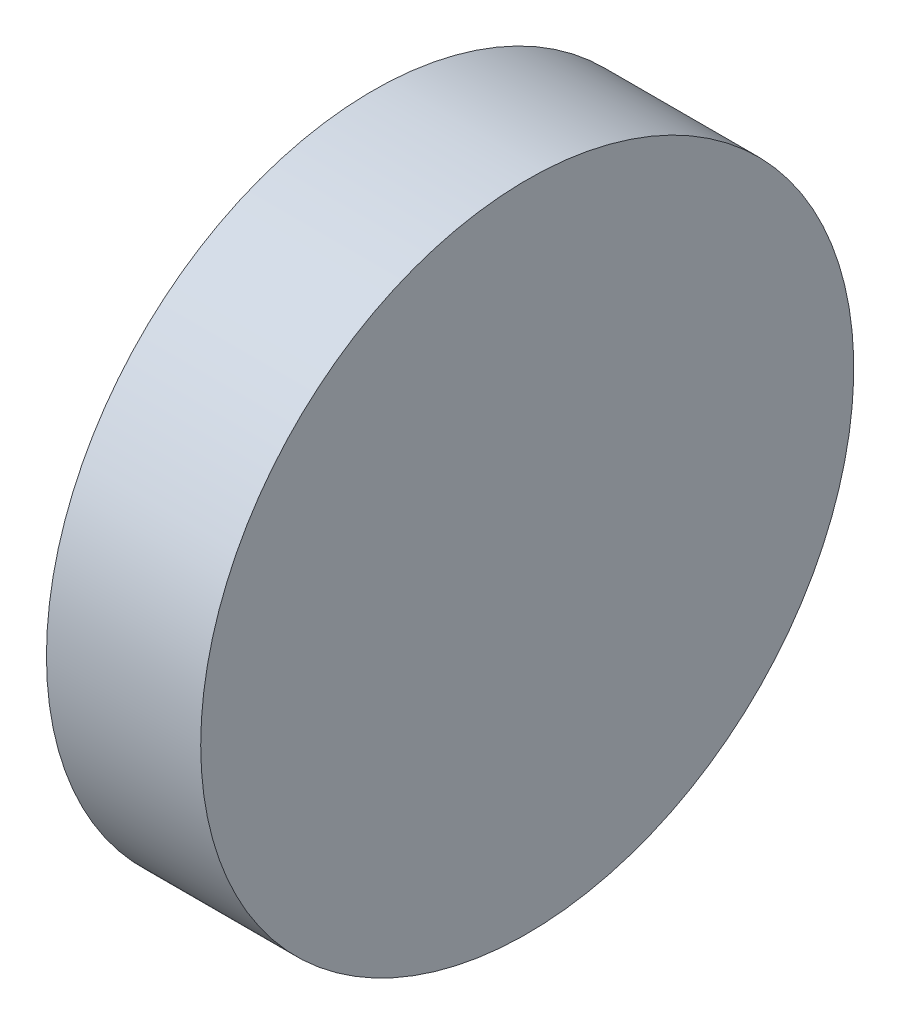
ISO-10303-21;
HEADER;
FILE_DESCRIPTION(('STEP AP214'),'2;1');
FILE_NAME('part.step','',(''),(''),'','','');
FILE_SCHEMA(('AUTOMOTIVE_DESIGN { 1 0 10303 214 1 1 1 1 }'));
ENDSEC;
DATA;
#1=APPLICATION_CONTEXT('core data for automotive mechanical design processes');
#2=APPLICATION_PROTOCOL_DEFINITION('international standard','automotive_design',2000,#1);
#3=PRODUCT_CONTEXT('',#1,'mechanical');
#4=PRODUCT('Part','Part','',(#3));
#5=PRODUCT_RELATED_PRODUCT_CATEGORY('part','',(#4));
#6=PRODUCT_DEFINITION_FORMATION('','',#4);
#7=PRODUCT_DEFINITION_CONTEXT('part definition',#1,'design');
#8=PRODUCT_DEFINITION('design','',#6,#7);
#9=PRODUCT_DEFINITION_SHAPE('','',#8);
#10=(LENGTH_UNIT() NAMED_UNIT(*) SI_UNIT(.MILLI.,.METRE.));
#11=(NAMED_UNIT(*) PLANE_ANGLE_UNIT() SI_UNIT($,.RADIAN.));
#12=(NAMED_UNIT(*) SI_UNIT($,.STERADIAN.) SOLID_ANGLE_UNIT());
#13=UNCERTAINTY_MEASURE_WITH_UNIT(LENGTH_MEASURE(1.E-05),#10,'distance_accuracy_value','');
#14=(GEOMETRIC_REPRESENTATION_CONTEXT(3) GLOBAL_UNCERTAINTY_ASSIGNED_CONTEXT((#13)) GLOBAL_UNIT_ASSIGNED_CONTEXT((#10,
#11,#12)) REPRESENTATION_CONTEXT('',''));
#15=CARTESIAN_POINT('',(0.,0.,0.));
#16=DIRECTION('',(0.,0.,1.));
#17=DIRECTION('',(1.,0.,0.));
#18=AXIS2_PLACEMENT_3D('',#15,#16,#17);
#19=CARTESIAN_POINT('',(0.,0.,0.));
#20=DIRECTION('',(-1.,0.,0.));
#21=DIRECTION('',(0.,0.,1.));
#22=AXIS2_PLACEMENT_3D('',#19,#20,#21);
#23=CYLINDRICAL_SURFACE('',#22,6.35);
#24=CARTESIAN_POINT('',(0.,0.,0.));
#25=DIRECTION('',(-1.,0.,0.));
#26=DIRECTION('',(0.,0.,1.));
#27=AXIS2_PLACEMENT_3D('',#24,#25,#26);
#28=CIRCLE('',#27,6.35);
#29=CARTESIAN_POINT('',(0.,0.,6.35));
#30=VERTEX_POINT('',#29);
#31=EDGE_CURVE('E44',#30,#30,#28,.T.);
#32=ORIENTED_EDGE('',*,*,#31,.F.);
#33=EDGE_LOOP('',(#32));
#34=FACE_BOUND('',#33,.T.);
#35=CARTESIAN_POINT('',(3.,0.,0.));
#36=DIRECTION('',(-1.,0.,0.));
#37=DIRECTION('',(0.,0.,1.));
#38=AXIS2_PLACEMENT_3D('',#35,#36,#37);
#39=CIRCLE('',#38,6.35);
#40=CARTESIAN_POINT('',(3.,0.,6.35));
#41=VERTEX_POINT('',#40);
#42=EDGE_CURVE('E10',#41,#41,#39,.T.);
#43=ORIENTED_EDGE('',*,*,#42,.T.);
#44=EDGE_LOOP('',(#43));
#45=FACE_BOUND('',#44,.T.);
#46=ADVANCED_FACE('F37',(#34,#45),#23,.T.);
#47=CARTESIAN_POINT('',(3.,6.35,0.));
#48=DIRECTION('',(-1.,0.,0.));
#49=DIRECTION('',(0.,0.,1.));
#50=AXIS2_PLACEMENT_3D('',#47,#48,#49);
#51=PLANE('',#50);
#52=ORIENTED_EDGE('',*,*,#42,.F.);
#53=EDGE_LOOP('',(#52));
#54=FACE_BOUND('',#53,.T.);
#55=ADVANCED_FACE('F54',(#54),#51,.F.);
#56=CARTESIAN_POINT('',(0.,6.35,0.));
#57=DIRECTION('',(1.,0.,0.));
#58=DIRECTION('',(0.,0.,-1.));
#59=AXIS2_PLACEMENT_3D('',#56,#57,#58);
#60=PLANE('',#59);
#61=ORIENTED_EDGE('',*,*,#31,.T.);
#62=EDGE_LOOP('',(#61));
#63=FACE_BOUND('',#62,.T.);
#64=ADVANCED_FACE('F51',(#63),#60,.F.);
#65=CLOSED_SHELL('',(#46,#55,#64));
#66=MANIFOLD_SOLID_BREP('B2',#65);
#67=ADVANCED_BREP_SHAPE_REPRESENTATION('',(#18,#66),#14);
#68=SHAPE_DEFINITION_REPRESENTATION(#9,#67);
ENDSEC;
END-ISO-10303-21;
